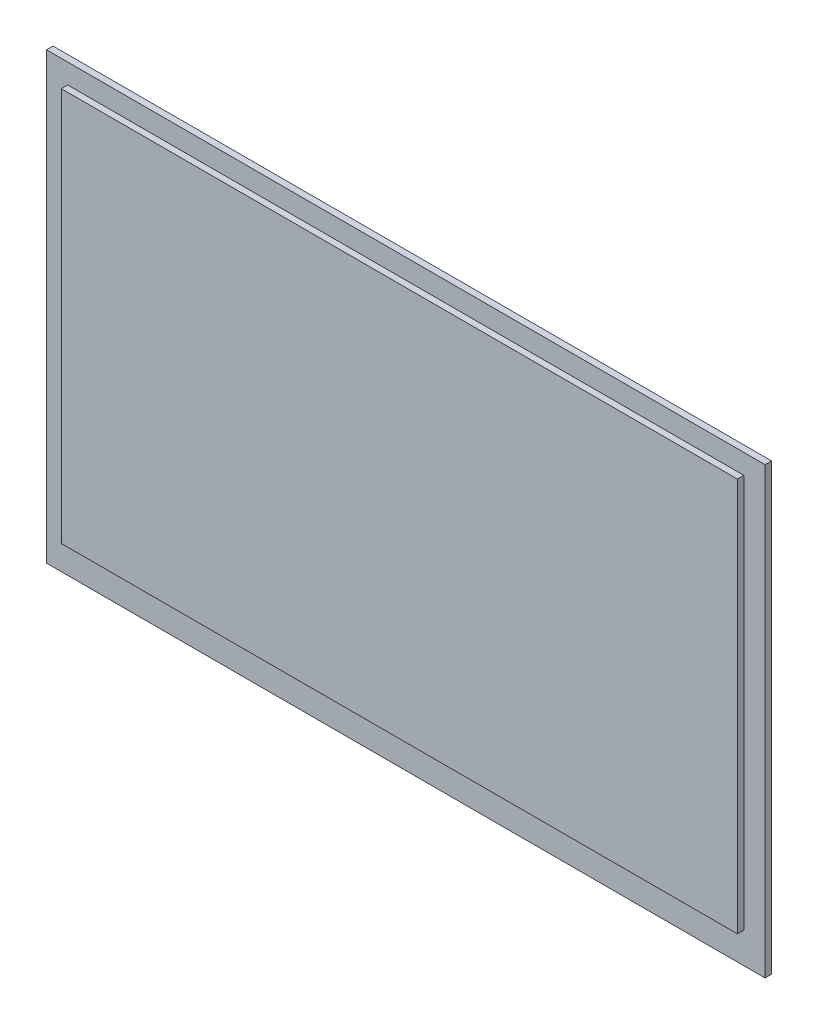
ISO-10303-21;
HEADER;
FILE_DESCRIPTION(('STEP AP214'),'2;1');
FILE_NAME('part.step','',(''),(''),'','','');
FILE_SCHEMA(('AUTOMOTIVE_DESIGN { 1 0 10303 214 1 1 1 1 }'));
ENDSEC;
DATA;
#1=APPLICATION_CONTEXT('core data for automotive mechanical design processes');
#2=APPLICATION_PROTOCOL_DEFINITION('international standard','automotive_design',2000,#1);
#3=PRODUCT_CONTEXT('',#1,'mechanical');
#4=PRODUCT('Part','Part','',(#3));
#5=PRODUCT_RELATED_PRODUCT_CATEGORY('part','',(#4));
#6=PRODUCT_DEFINITION_FORMATION('','',#4);
#7=PRODUCT_DEFINITION_CONTEXT('part definition',#1,'design');
#8=PRODUCT_DEFINITION('design','',#6,#7);
#9=PRODUCT_DEFINITION_SHAPE('','',#8);
#10=(LENGTH_UNIT() NAMED_UNIT(*) SI_UNIT(.MILLI.,.METRE.));
#11=(NAMED_UNIT(*) PLANE_ANGLE_UNIT() SI_UNIT($,.RADIAN.));
#12=(NAMED_UNIT(*) SI_UNIT($,.STERADIAN.) SOLID_ANGLE_UNIT());
#13=UNCERTAINTY_MEASURE_WITH_UNIT(LENGTH_MEASURE(1.E-05),#10,'distance_accuracy_value','');
#14=(GEOMETRIC_REPRESENTATION_CONTEXT(3) GLOBAL_UNCERTAINTY_ASSIGNED_CONTEXT((#13)) GLOBAL_UNIT_ASSIGNED_CONTEXT((#10,
#11,#12)) REPRESENTATION_CONTEXT('',''));
#15=CARTESIAN_POINT('',(0.,0.,0.));
#16=DIRECTION('',(0.,0.,1.));
#17=DIRECTION('',(1.,0.,0.));
#18=AXIS2_PLACEMENT_3D('',#15,#16,#17);
#19=CARTESIAN_POINT('',(52.45,32.45,0.95));
#20=DIRECTION('',(0.,0.,-1.));
#21=DIRECTION('',(-1.,0.,0.));
#22=AXIS2_PLACEMENT_3D('',#19,#20,#21);
#23=PLANE('',#22);
#24=DIRECTION('',(0.,1.,0.));
#25=VECTOR('',#24,1.);
#26=CARTESIAN_POINT('',(52.45,-32.45,0.95));
#27=LINE('',#26,#25);
#28=CARTESIAN_POINT('',(52.45,-32.45,0.95));
#29=VERTEX_POINT('',#28);
#30=CARTESIAN_POINT('',(52.45,32.45,0.95));
#31=VERTEX_POINT('',#30);
#32=EDGE_CURVE('E129',#29,#31,#27,.T.);
#33=ORIENTED_EDGE('',*,*,#32,.T.);
#34=DIRECTION('',(-1.,0.,0.));
#35=VECTOR('',#34,1.);
#36=CARTESIAN_POINT('',(-52.45,32.45,0.95));
#37=LINE('',#36,#35);
#38=CARTESIAN_POINT('',(-52.45,32.45,0.95));
#39=VERTEX_POINT('',#38);
#40=EDGE_CURVE('E132',#31,#39,#37,.T.);
#41=ORIENTED_EDGE('',*,*,#40,.T.);
#42=DIRECTION('',(0.,-1.,0.));
#43=VECTOR('',#42,1.);
#44=CARTESIAN_POINT('',(-52.45,-32.45,0.95));
#45=LINE('',#44,#43);
#46=CARTESIAN_POINT('',(-52.45,-32.45,0.95));
#47=VERTEX_POINT('',#46);
#48=EDGE_CURVE('E135',#39,#47,#45,.T.);
#49=ORIENTED_EDGE('',*,*,#48,.T.);
#50=DIRECTION('',(1.,0.,0.));
#51=VECTOR('',#50,1.);
#52=CARTESIAN_POINT('',(-52.45,-32.45,0.95));
#53=LINE('',#52,#51);
#54=EDGE_CURVE('E137',#47,#29,#53,.T.);
#55=ORIENTED_EDGE('',*,*,#54,.T.);
#56=EDGE_LOOP('',(#33,#41,#49,#55));
#57=FACE_BOUND('',#56,.T.);
#58=DIRECTION('',(0.,1.,0.));
#59=VECTOR('',#58,1.);
#60=CARTESIAN_POINT('',(49.35,-27.95,0.95));
#61=LINE('',#60,#59);
#62=CARTESIAN_POINT('',(49.35,-27.95,0.95));
#63=VERTEX_POINT('',#62);
#64=CARTESIAN_POINT('',(49.35,29.55,0.95));
#65=VERTEX_POINT('',#64);
#66=EDGE_CURVE('E119',#63,#65,#61,.T.);
#67=ORIENTED_EDGE('',*,*,#66,.F.);
#68=DIRECTION('',(1.,0.,0.));
#69=VECTOR('',#68,1.);
#70=CARTESIAN_POINT('',(-49.35,-27.95,0.95));
#71=LINE('',#70,#69);
#72=CARTESIAN_POINT('',(-49.35,-27.95,0.95));
#73=VERTEX_POINT('',#72);
#74=EDGE_CURVE('E116',#73,#63,#71,.T.);
#75=ORIENTED_EDGE('',*,*,#74,.F.);
#76=DIRECTION('',(0.,-1.,0.));
#77=VECTOR('',#76,1.);
#78=CARTESIAN_POINT('',(-49.35,-27.95,0.95));
#79=LINE('',#78,#77);
#80=CARTESIAN_POINT('',(-49.35,29.55,0.95));
#81=VERTEX_POINT('',#80);
#82=EDGE_CURVE('E54',#81,#73,#79,.T.);
#83=ORIENTED_EDGE('',*,*,#82,.F.);
#84=DIRECTION('',(-1.,0.,0.));
#85=VECTOR('',#84,1.);
#86=CARTESIAN_POINT('',(-49.35,29.55,0.95));
#87=LINE('',#86,#85);
#88=EDGE_CURVE('E49',#65,#81,#87,.T.);
#89=ORIENTED_EDGE('',*,*,#88,.F.);
#90=EDGE_LOOP('',(#67,#75,#83,#89));
#91=FACE_BOUND('',#90,.T.);
#92=ADVANCED_FACE('F34',(#57,#91),#23,.F.);
#93=CARTESIAN_POINT('',(52.45,-32.45,0.95));
#94=DIRECTION('',(-1.,0.,0.));
#95=DIRECTION('',(0.,0.,1.));
#96=AXIS2_PLACEMENT_3D('',#93,#94,#95);
#97=PLANE('',#96);
#98=DIRECTION('',(0.,1.,0.));
#99=VECTOR('',#98,1.);
#100=CARTESIAN_POINT('',(52.45,-32.45,0.));
#101=LINE('',#100,#99);
#102=CARTESIAN_POINT('',(52.45,-32.45,0.));
#103=VERTEX_POINT('',#102);
#104=CARTESIAN_POINT('',(52.45,32.45,0.));
#105=VERTEX_POINT('',#104);
#106=EDGE_CURVE('E120',#103,#105,#101,.T.);
#107=ORIENTED_EDGE('',*,*,#106,.T.);
#108=DIRECTION('',(0.,0.,-1.));
#109=VECTOR('',#108,1.);
#110=CARTESIAN_POINT('',(52.45,32.45,0.95));
#111=LINE('',#110,#109);
#112=EDGE_CURVE('E11',#31,#105,#111,.T.);
#113=ORIENTED_EDGE('',*,*,#112,.F.);
#114=ORIENTED_EDGE('',*,*,#32,.F.);
#115=DIRECTION('',(0.,0.,-1.));
#116=VECTOR('',#115,1.);
#117=CARTESIAN_POINT('',(52.45,-32.45,0.95));
#118=LINE('',#117,#116);
#119=EDGE_CURVE('E138',#29,#103,#118,.T.);
#120=ORIENTED_EDGE('',*,*,#119,.T.);
#121=EDGE_LOOP('',(#107,#113,#114,#120));
#122=FACE_BOUND('',#121,.T.);
#123=ADVANCED_FACE('F36',(#122),#97,.F.);
#124=CARTESIAN_POINT('',(-52.45,32.45,0.95));
#125=DIRECTION('',(0.,-1.,0.));
#126=DIRECTION('',(0.,0.,-1.));
#127=AXIS2_PLACEMENT_3D('',#124,#125,#126);
#128=PLANE('',#127);
#129=DIRECTION('',(-1.,0.,0.));
#130=VECTOR('',#129,1.);
#131=CARTESIAN_POINT('',(-52.45,32.45,0.));
#132=LINE('',#131,#130);
#133=CARTESIAN_POINT('',(-52.45,32.45,0.));
#134=VERTEX_POINT('',#133);
#135=EDGE_CURVE('E123',#105,#134,#132,.T.);
#136=ORIENTED_EDGE('',*,*,#135,.T.);
#137=DIRECTION('',(0.,0.,-1.));
#138=VECTOR('',#137,1.);
#139=CARTESIAN_POINT('',(-52.45,32.45,0.95));
#140=LINE('',#139,#138);
#141=EDGE_CURVE('E42',#39,#134,#140,.T.);
#142=ORIENTED_EDGE('',*,*,#141,.F.);
#143=ORIENTED_EDGE('',*,*,#40,.F.);
#144=ORIENTED_EDGE('',*,*,#112,.T.);
#145=EDGE_LOOP('',(#136,#142,#143,#144));
#146=FACE_BOUND('',#145,.T.);
#147=ADVANCED_FACE('F168',(#146),#128,.F.);
#148=CARTESIAN_POINT('',(-52.45,-32.45,0.95));
#149=DIRECTION('',(1.,0.,0.));
#150=DIRECTION('',(0.,0.,-1.));
#151=AXIS2_PLACEMENT_3D('',#148,#149,#150);
#152=PLANE('',#151);
#153=DIRECTION('',(0.,-1.,0.));
#154=VECTOR('',#153,1.);
#155=CARTESIAN_POINT('',(-52.45,-32.45,0.));
#156=LINE('',#155,#154);
#157=CARTESIAN_POINT('',(-52.45,-32.45,0.));
#158=VERTEX_POINT('',#157);
#159=EDGE_CURVE('E141',#134,#158,#156,.T.);
#160=ORIENTED_EDGE('',*,*,#159,.T.);
#161=DIRECTION('',(0.,0.,-1.));
#162=VECTOR('',#161,1.);
#163=CARTESIAN_POINT('',(-52.45,-32.45,0.95));
#164=LINE('',#163,#162);
#165=EDGE_CURVE('E146',#47,#158,#164,.T.);
#166=ORIENTED_EDGE('',*,*,#165,.F.);
#167=ORIENTED_EDGE('',*,*,#48,.F.);
#168=ORIENTED_EDGE('',*,*,#141,.T.);
#169=EDGE_LOOP('',(#160,#166,#167,#168));
#170=FACE_BOUND('',#169,.T.);
#171=ADVANCED_FACE('F153',(#170),#152,.F.);
#172=CARTESIAN_POINT('',(-52.45,-32.45,0.95));
#173=DIRECTION('',(0.,1.,0.));
#174=DIRECTION('',(0.,0.,1.));
#175=AXIS2_PLACEMENT_3D('',#172,#173,#174);
#176=PLANE('',#175);
#177=DIRECTION('',(1.,0.,0.));
#178=VECTOR('',#177,1.);
#179=CARTESIAN_POINT('',(-52.45,-32.45,0.));
#180=LINE('',#179,#178);
#181=EDGE_CURVE('E133',#158,#103,#180,.T.);
#182=ORIENTED_EDGE('',*,*,#181,.T.);
#183=ORIENTED_EDGE('',*,*,#119,.F.);
#184=ORIENTED_EDGE('',*,*,#54,.F.);
#185=ORIENTED_EDGE('',*,*,#165,.T.);
#186=EDGE_LOOP('',(#182,#183,#184,#185));
#187=FACE_BOUND('',#186,.T.);
#188=ADVANCED_FACE('F162',(#187),#176,.F.);
#189=CARTESIAN_POINT('',(52.45,32.45,0.));
#190=DIRECTION('',(0.,0.,-1.));
#191=DIRECTION('',(-1.,0.,0.));
#192=AXIS2_PLACEMENT_3D('',#189,#190,#191);
#193=PLANE('',#192);
#194=ORIENTED_EDGE('',*,*,#106,.F.);
#195=ORIENTED_EDGE('',*,*,#181,.F.);
#196=ORIENTED_EDGE('',*,*,#159,.F.);
#197=ORIENTED_EDGE('',*,*,#135,.F.);
#198=EDGE_LOOP('',(#194,#195,#196,#197));
#199=FACE_BOUND('',#198,.T.);
#200=ADVANCED_FACE('F159',(#199),#193,.T.);
#201=CARTESIAN_POINT('',(49.35,-27.95,1.885));
#202=DIRECTION('',(-1.,0.,0.));
#203=DIRECTION('',(0.,0.,1.));
#204=AXIS2_PLACEMENT_3D('',#201,#202,#203);
#205=PLANE('',#204);
#206=ORIENTED_EDGE('',*,*,#66,.T.);
#207=DIRECTION('',(0.,0.,-1.));
#208=VECTOR('',#207,1.);
#209=CARTESIAN_POINT('',(49.35,29.55,1.885));
#210=LINE('',#209,#208);
#211=CARTESIAN_POINT('',(49.35,29.55,1.885));
#212=VERTEX_POINT('',#211);
#213=EDGE_CURVE('E100',#212,#65,#210,.T.);
#214=ORIENTED_EDGE('',*,*,#213,.F.);
#215=DIRECTION('',(0.,1.,0.));
#216=VECTOR('',#215,1.);
#217=CARTESIAN_POINT('',(49.35,-27.95,1.885));
#218=LINE('',#217,#216);
#219=CARTESIAN_POINT('',(49.35,-27.95,1.885));
#220=VERTEX_POINT('',#219);
#221=EDGE_CURVE('E107',#220,#212,#218,.T.);
#222=ORIENTED_EDGE('',*,*,#221,.F.);
#223=DIRECTION('',(0.,0.,-1.));
#224=VECTOR('',#223,1.);
#225=CARTESIAN_POINT('',(49.35,-27.95,1.885));
#226=LINE('',#225,#224);
#227=EDGE_CURVE('E264',#220,#63,#226,.T.);
#228=ORIENTED_EDGE('',*,*,#227,.T.);
#229=EDGE_LOOP('',(#206,#214,#222,#228));
#230=FACE_BOUND('',#229,.T.);
#231=ADVANCED_FACE('F118',(#230),#205,.F.);
#232=CARTESIAN_POINT('',(-49.35,29.55,1.885));
#233=DIRECTION('',(0.,-1.,0.));
#234=DIRECTION('',(0.,0.,-1.));
#235=AXIS2_PLACEMENT_3D('',#232,#233,#234);
#236=PLANE('',#235);
#237=ORIENTED_EDGE('',*,*,#88,.T.);
#238=DIRECTION('',(0.,0.,-1.));
#239=VECTOR('',#238,1.);
#240=CARTESIAN_POINT('',(-49.35,29.55,1.885));
#241=LINE('',#240,#239);
#242=CARTESIAN_POINT('',(-49.35,29.55,1.885));
#243=VERTEX_POINT('',#242);
#244=EDGE_CURVE('E103',#243,#81,#241,.T.);
#245=ORIENTED_EDGE('',*,*,#244,.F.);
#246=DIRECTION('',(-1.,0.,0.));
#247=VECTOR('',#246,1.);
#248=CARTESIAN_POINT('',(-49.35,29.55,1.885));
#249=LINE('',#248,#247);
#250=EDGE_CURVE('E96',#212,#243,#249,.T.);
#251=ORIENTED_EDGE('',*,*,#250,.F.);
#252=ORIENTED_EDGE('',*,*,#213,.T.);
#253=EDGE_LOOP('',(#237,#245,#251,#252));
#254=FACE_BOUND('',#253,.T.);
#255=ADVANCED_FACE('F98',(#254),#236,.F.);
#256=CARTESIAN_POINT('',(-49.35,-27.95,1.885));
#257=DIRECTION('',(1.,0.,0.));
#258=DIRECTION('',(0.,0.,-1.));
#259=AXIS2_PLACEMENT_3D('',#256,#257,#258);
#260=PLANE('',#259);
#261=ORIENTED_EDGE('',*,*,#82,.T.);
#262=DIRECTION('',(0.,0.,-1.));
#263=VECTOR('',#262,1.);
#264=CARTESIAN_POINT('',(-49.35,-27.95,1.885));
#265=LINE('',#264,#263);
#266=CARTESIAN_POINT('',(-49.35,-27.95,1.885));
#267=VERTEX_POINT('',#266);
#268=EDGE_CURVE('E125',#267,#73,#265,.T.);
#269=ORIENTED_EDGE('',*,*,#268,.F.);
#270=DIRECTION('',(0.,-1.,0.));
#271=VECTOR('',#270,1.);
#272=CARTESIAN_POINT('',(-49.35,-27.95,1.885));
#273=LINE('',#272,#271);
#274=EDGE_CURVE('E106',#243,#267,#273,.T.);
#275=ORIENTED_EDGE('',*,*,#274,.F.);
#276=ORIENTED_EDGE('',*,*,#244,.T.);
#277=EDGE_LOOP('',(#261,#269,#275,#276));
#278=FACE_BOUND('',#277,.T.);
#279=ADVANCED_FACE('F204',(#278),#260,.F.);
#280=CARTESIAN_POINT('',(-49.35,-27.95,1.885));
#281=DIRECTION('',(0.,1.,0.));
#282=DIRECTION('',(0.,0.,1.));
#283=AXIS2_PLACEMENT_3D('',#280,#281,#282);
#284=PLANE('',#283);
#285=ORIENTED_EDGE('',*,*,#74,.T.);
#286=ORIENTED_EDGE('',*,*,#227,.F.);
#287=DIRECTION('',(1.,0.,0.));
#288=VECTOR('',#287,1.);
#289=CARTESIAN_POINT('',(-49.35,-27.95,1.885));
#290=LINE('',#289,#288);
#291=EDGE_CURVE('E112',#267,#220,#290,.T.);
#292=ORIENTED_EDGE('',*,*,#291,.F.);
#293=ORIENTED_EDGE('',*,*,#268,.T.);
#294=EDGE_LOOP('',(#285,#286,#292,#293));
#295=FACE_BOUND('',#294,.T.);
#296=ADVANCED_FACE('F210',(#295),#284,.F.);
#297=CARTESIAN_POINT('',(49.35,29.55,1.885));
#298=DIRECTION('',(0.,0.,-1.));
#299=DIRECTION('',(-1.,0.,0.));
#300=AXIS2_PLACEMENT_3D('',#297,#298,#299);
#301=PLANE('',#300);
#302=ORIENTED_EDGE('',*,*,#221,.T.);
#303=ORIENTED_EDGE('',*,*,#250,.T.);
#304=ORIENTED_EDGE('',*,*,#274,.T.);
#305=ORIENTED_EDGE('',*,*,#291,.T.);
#306=EDGE_LOOP('',(#302,#303,#304,#305));
#307=FACE_BOUND('',#306,.T.);
#308=ADVANCED_FACE('F110',(#307),#301,.F.);
#309=CLOSED_SHELL('',(#92,#123,#147,#171,#188,#200,#231,#255,#279,#296,#308));
#310=MANIFOLD_SOLID_BREP('B2',#309);
#311=ADVANCED_BREP_SHAPE_REPRESENTATION('',(#18,#310),#14);
#312=SHAPE_DEFINITION_REPRESENTATION(#9,#311);
ENDSEC;
END-ISO-10303-21;
